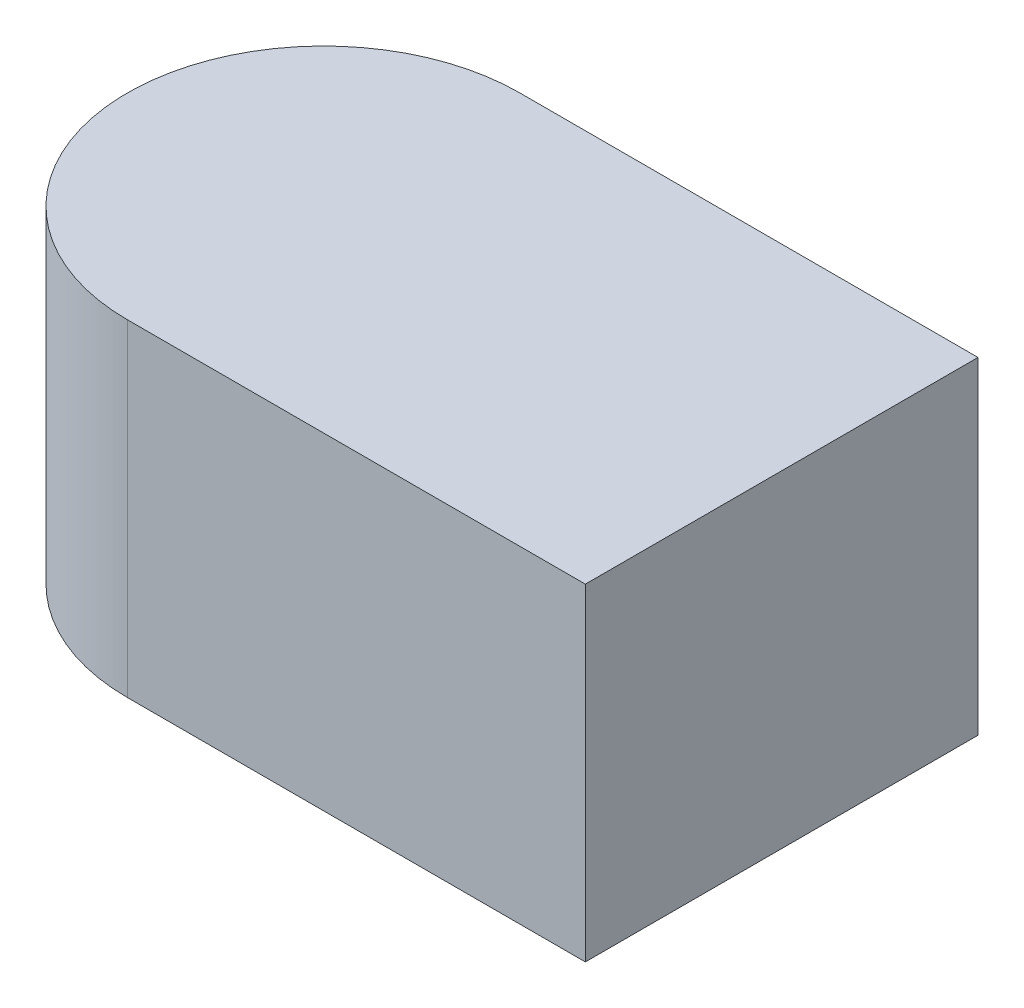
ISO-10303-21;
HEADER;
FILE_DESCRIPTION(('STEP AP214'),'2;1');
FILE_NAME('part.step','',(''),(''),'','','');
FILE_SCHEMA(('AUTOMOTIVE_DESIGN { 1 0 10303 214 1 1 1 1 }'));
ENDSEC;
DATA;
#1=APPLICATION_CONTEXT('core data for automotive mechanical design processes');
#2=APPLICATION_PROTOCOL_DEFINITION('international standard','automotive_design',2000,#1);
#3=PRODUCT_CONTEXT('',#1,'mechanical');
#4=PRODUCT('Part','Part','',(#3));
#5=PRODUCT_RELATED_PRODUCT_CATEGORY('part','',(#4));
#6=PRODUCT_DEFINITION_FORMATION('','',#4);
#7=PRODUCT_DEFINITION_CONTEXT('part definition',#1,'design');
#8=PRODUCT_DEFINITION('design','',#6,#7);
#9=PRODUCT_DEFINITION_SHAPE('','',#8);
#10=(LENGTH_UNIT() NAMED_UNIT(*) SI_UNIT(.MILLI.,.METRE.));
#11=(NAMED_UNIT(*) PLANE_ANGLE_UNIT() SI_UNIT($,.RADIAN.));
#12=(NAMED_UNIT(*) SI_UNIT($,.STERADIAN.) SOLID_ANGLE_UNIT());
#13=UNCERTAINTY_MEASURE_WITH_UNIT(LENGTH_MEASURE(1.E-05),#10,'distance_accuracy_value','');
#14=(GEOMETRIC_REPRESENTATION_CONTEXT(3) GLOBAL_UNCERTAINTY_ASSIGNED_CONTEXT((#13)) GLOBAL_UNIT_ASSIGNED_CONTEXT((#10,
#11,#12)) REPRESENTATION_CONTEXT('',''));
#15=CARTESIAN_POINT('',(0.,0.,0.));
#16=DIRECTION('',(0.,0.,1.));
#17=DIRECTION('',(1.,0.,0.));
#18=AXIS2_PLACEMENT_3D('',#15,#16,#17);
#19=CARTESIAN_POINT('',(0.,0.,0.));
#20=DIRECTION('',(0.,1.,0.));
#21=DIRECTION('',(1.,0.,0.));
#22=AXIS2_PLACEMENT_3D('',#19,#20,#21);
#23=PLANE('',#22);
#24=DIRECTION('',(0.,0.,-1.));
#25=VECTOR('',#24,1.);
#26=CARTESIAN_POINT('',(1.75,0.,-0.63));
#27=LINE('',#26,#25);
#28=CARTESIAN_POINT('',(1.75,0.,-0.63));
#29=VERTEX_POINT('',#28);
#30=CARTESIAN_POINT('',(1.75,0.,-0.87));
#31=VERTEX_POINT('',#30);
#32=EDGE_CURVE('E11',#29,#31,#27,.T.);
#33=ORIENTED_EDGE('',*,*,#32,.F.);
#34=DIRECTION('',(1.,0.,0.));
#35=VECTOR('',#34,1.);
#36=CARTESIAN_POINT('',(1.47,0.,-0.63));
#37=LINE('',#36,#35);
#38=CARTESIAN_POINT('',(1.47,0.,-0.63));
#39=VERTEX_POINT('',#38);
#40=EDGE_CURVE('E24',#39,#29,#37,.T.);
#41=ORIENTED_EDGE('',*,*,#40,.F.);
#42=CARTESIAN_POINT('',(1.47,0.,-0.75));
#43=DIRECTION('',(0.,1.,0.));
#44=DIRECTION('',(0.,0.,-1.));
#45=AXIS2_PLACEMENT_3D('',#42,#43,#44);
#46=CIRCLE('',#45,0.12);
#47=CARTESIAN_POINT('',(1.47,0.,-0.87));
#48=VERTEX_POINT('',#47);
#49=EDGE_CURVE('E61',#48,#39,#46,.T.);
#50=ORIENTED_EDGE('',*,*,#49,.F.);
#51=DIRECTION('',(-1.,0.,0.));
#52=VECTOR('',#51,1.);
#53=CARTESIAN_POINT('',(1.75,0.,-0.87));
#54=LINE('',#53,#52);
#55=EDGE_CURVE('E37',#31,#48,#54,.T.);
#56=ORIENTED_EDGE('',*,*,#55,.F.);
#57=EDGE_LOOP('',(#33,#41,#50,#56));
#58=FACE_BOUND('',#57,.T.);
#59=ADVANCED_FACE('F17',(#58),#23,.F.);
#60=CARTESIAN_POINT('',(1.75,0.,-0.87));
#61=DIRECTION('',(0.,0.,-1.));
#62=DIRECTION('',(-1.,0.,0.));
#63=AXIS2_PLACEMENT_3D('',#60,#61,#62);
#64=PLANE('',#63);
#65=DIRECTION('',(0.,1.,0.));
#66=VECTOR('',#65,1.);
#67=CARTESIAN_POINT('',(1.47,0.,-0.87));
#68=LINE('',#67,#66);
#69=CARTESIAN_POINT('',(1.47,0.2,-0.87));
#70=VERTEX_POINT('',#69);
#71=EDGE_CURVE('E84',#48,#70,#68,.T.);
#72=ORIENTED_EDGE('',*,*,#71,.T.);
#73=DIRECTION('',(-1.,0.,0.));
#74=VECTOR('',#73,1.);
#75=CARTESIAN_POINT('',(1.75,0.2,-0.87));
#76=LINE('',#75,#74);
#77=CARTESIAN_POINT('',(1.75,0.2,-0.87));
#78=VERTEX_POINT('',#77);
#79=EDGE_CURVE('E74',#78,#70,#76,.T.);
#80=ORIENTED_EDGE('',*,*,#79,.F.);
#81=DIRECTION('',(0.,1.,0.));
#82=VECTOR('',#81,1.);
#83=CARTESIAN_POINT('',(1.75,0.,-0.87));
#84=LINE('',#83,#82);
#85=EDGE_CURVE('E81',#31,#78,#84,.T.);
#86=ORIENTED_EDGE('',*,*,#85,.F.);
#87=ORIENTED_EDGE('',*,*,#55,.T.);
#88=EDGE_LOOP('',(#72,#80,#86,#87));
#89=FACE_BOUND('',#88,.T.);
#90=ADVANCED_FACE('F89',(#89),#64,.T.);
#91=CARTESIAN_POINT('',(1.75,0.,-0.63));
#92=DIRECTION('',(1.,0.,0.));
#93=DIRECTION('',(0.,0.,-1.));
#94=AXIS2_PLACEMENT_3D('',#91,#92,#93);
#95=PLANE('',#94);
#96=ORIENTED_EDGE('',*,*,#85,.T.);
#97=DIRECTION('',(0.,0.,-1.));
#98=VECTOR('',#97,1.);
#99=CARTESIAN_POINT('',(1.75,0.2,-0.63));
#100=LINE('',#99,#98);
#101=CARTESIAN_POINT('',(1.75,0.2,-0.63));
#102=VERTEX_POINT('',#101);
#103=EDGE_CURVE('E79',#102,#78,#100,.T.);
#104=ORIENTED_EDGE('',*,*,#103,.F.);
#105=DIRECTION('',(0.,1.,0.));
#106=VECTOR('',#105,1.);
#107=CARTESIAN_POINT('',(1.75,0.,-0.63));
#108=LINE('',#107,#106);
#109=EDGE_CURVE('E67',#29,#102,#108,.T.);
#110=ORIENTED_EDGE('',*,*,#109,.F.);
#111=ORIENTED_EDGE('',*,*,#32,.T.);
#112=EDGE_LOOP('',(#96,#104,#110,#111));
#113=FACE_BOUND('',#112,.T.);
#114=ADVANCED_FACE('F91',(#113),#95,.T.);
#115=CARTESIAN_POINT('',(1.47,0.,-0.63));
#116=DIRECTION('',(0.,0.,1.));
#117=DIRECTION('',(1.,0.,0.));
#118=AXIS2_PLACEMENT_3D('',#115,#116,#117);
#119=PLANE('',#118);
#120=ORIENTED_EDGE('',*,*,#109,.T.);
#121=DIRECTION('',(1.,0.,0.));
#122=VECTOR('',#121,1.);
#123=CARTESIAN_POINT('',(1.47,0.2,-0.63));
#124=LINE('',#123,#122);
#125=CARTESIAN_POINT('',(1.47,0.2,-0.63));
#126=VERTEX_POINT('',#125);
#127=EDGE_CURVE('E62',#126,#102,#124,.T.);
#128=ORIENTED_EDGE('',*,*,#127,.F.);
#129=DIRECTION('',(0.,1.,0.));
#130=VECTOR('',#129,1.);
#131=CARTESIAN_POINT('',(1.47,0.,-0.63));
#132=LINE('',#131,#130);
#133=EDGE_CURVE('E55',#39,#126,#132,.T.);
#134=ORIENTED_EDGE('',*,*,#133,.F.);
#135=ORIENTED_EDGE('',*,*,#40,.T.);
#136=EDGE_LOOP('',(#120,#128,#134,#135));
#137=FACE_BOUND('',#136,.T.);
#138=ADVANCED_FACE('F65',(#137),#119,.T.);
#139=CARTESIAN_POINT('',(1.47,0.,-0.75));
#140=DIRECTION('',(0.,1.,0.));
#141=DIRECTION('',(1.,0.,0.));
#142=AXIS2_PLACEMENT_3D('',#139,#140,#141);
#143=CYLINDRICAL_SURFACE('',#142,0.12);
#144=ORIENTED_EDGE('',*,*,#133,.T.);
#145=CARTESIAN_POINT('',(1.47,0.2,-0.75));
#146=DIRECTION('',(0.,1.,0.));
#147=DIRECTION('',(0.,0.,-1.));
#148=AXIS2_PLACEMENT_3D('',#145,#146,#147);
#149=CIRCLE('',#148,0.12);
#150=EDGE_CURVE('E60',#70,#126,#149,.T.);
#151=ORIENTED_EDGE('',*,*,#150,.F.);
#152=ORIENTED_EDGE('',*,*,#71,.F.);
#153=ORIENTED_EDGE('',*,*,#49,.T.);
#154=EDGE_LOOP('',(#144,#151,#152,#153));
#155=FACE_BOUND('',#154,.T.);
#156=ADVANCED_FACE('F57',(#155),#143,.T.);
#157=CARTESIAN_POINT('',(0.,0.2,0.));
#158=DIRECTION('',(0.,1.,0.));
#159=DIRECTION('',(1.,0.,0.));
#160=AXIS2_PLACEMENT_3D('',#157,#158,#159);
#161=PLANE('',#160);
#162=ORIENTED_EDGE('',*,*,#150,.T.);
#163=ORIENTED_EDGE('',*,*,#127,.T.);
#164=ORIENTED_EDGE('',*,*,#103,.T.);
#165=ORIENTED_EDGE('',*,*,#79,.T.);
#166=EDGE_LOOP('',(#162,#163,#164,#165));
#167=FACE_BOUND('',#166,.T.);
#168=ADVANCED_FACE('F72',(#167),#161,.T.);
#169=CLOSED_SHELL('',(#59,#90,#114,#138,#156,#168));
#170=MANIFOLD_SOLID_BREP('B1',#169);
#171=ADVANCED_BREP_SHAPE_REPRESENTATION('',(#18,#170),#14);
#172=SHAPE_DEFINITION_REPRESENTATION(#9,#171);
ENDSEC;
END-ISO-10303-21;
